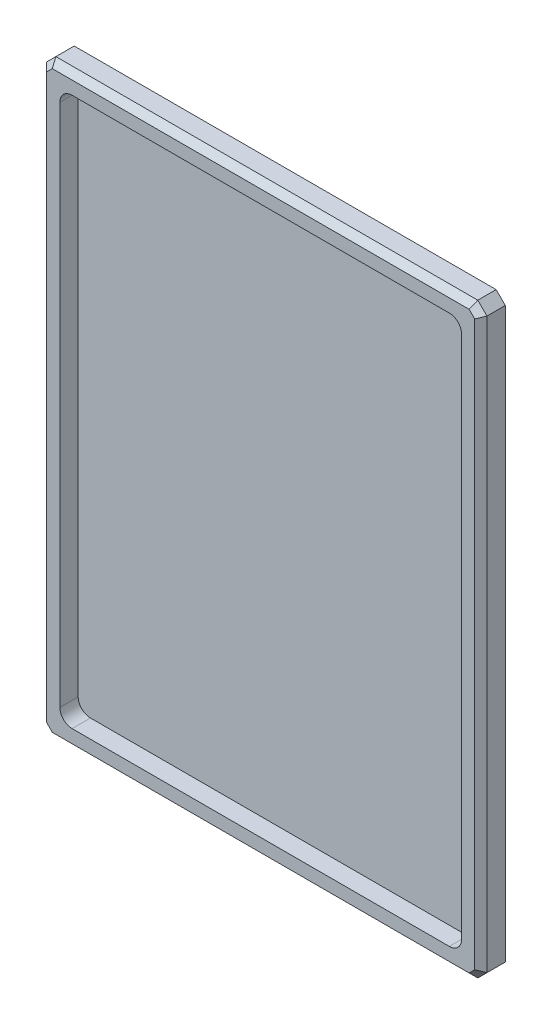
ISO-10303-21;
HEADER;
FILE_DESCRIPTION(('STEP AP214'),'2;1');
FILE_NAME('part.step','',(''),(''),'','','');
FILE_SCHEMA(('AUTOMOTIVE_DESIGN { 1 0 10303 214 1 1 1 1 }'));
ENDSEC;
DATA;
#1=APPLICATION_CONTEXT('core data for automotive mechanical design processes');
#2=APPLICATION_PROTOCOL_DEFINITION('international standard','automotive_design',2000,#1);
#3=PRODUCT_CONTEXT('',#1,'mechanical');
#4=PRODUCT('Part','Part','',(#3));
#5=PRODUCT_RELATED_PRODUCT_CATEGORY('part','',(#4));
#6=PRODUCT_DEFINITION_FORMATION('','',#4);
#7=PRODUCT_DEFINITION_CONTEXT('part definition',#1,'design');
#8=PRODUCT_DEFINITION('design','',#6,#7);
#9=PRODUCT_DEFINITION_SHAPE('','',#8);
#10=(LENGTH_UNIT() NAMED_UNIT(*) SI_UNIT(.MILLI.,.METRE.));
#11=(NAMED_UNIT(*) PLANE_ANGLE_UNIT() SI_UNIT($,.RADIAN.));
#12=(NAMED_UNIT(*) SI_UNIT($,.STERADIAN.) SOLID_ANGLE_UNIT());
#13=UNCERTAINTY_MEASURE_WITH_UNIT(LENGTH_MEASURE(1.E-05),#10,'distance_accuracy_value','');
#14=(GEOMETRIC_REPRESENTATION_CONTEXT(3) GLOBAL_UNCERTAINTY_ASSIGNED_CONTEXT((#13)) GLOBAL_UNIT_ASSIGNED_CONTEXT((#10,
#11,#12)) REPRESENTATION_CONTEXT('',''));
#15=CARTESIAN_POINT('',(0.,0.,0.));
#16=DIRECTION('',(0.,0.,1.));
#17=DIRECTION('',(1.,0.,0.));
#18=AXIS2_PLACEMENT_3D('',#15,#16,#17);
#19=CARTESIAN_POINT('',(-114.3,-152.4,12.7));
#20=DIRECTION('',(1.,0.,0.));
#21=DIRECTION('',(0.,0.,-1.));
#22=AXIS2_PLACEMENT_3D('',#19,#20,#21);
#23=PLANE('',#22);
#24=DIRECTION('',(0.,0.,1.));
#25=VECTOR('',#24,1.);
#26=CARTESIAN_POINT('',(-114.3,-147.6375,12.7));
#27=LINE('',#26,#25);
#28=CARTESIAN_POINT('',(-114.3,-147.6375,0.));
#29=VERTEX_POINT('',#28);
#30=CARTESIAN_POINT('',(-114.3,-147.6375,9.52500000000001));
#31=VERTEX_POINT('',#30);
#32=EDGE_CURVE('E284',#29,#31,#27,.T.);
#33=ORIENTED_EDGE('',*,*,#32,.T.);
#34=DIRECTION('',(0.,1.,0.));
#35=VECTOR('',#34,1.);
#36=CARTESIAN_POINT('',(-114.3,147.6375,9.52500000000002));
#37=LINE('',#36,#35);
#38=CARTESIAN_POINT('',(-114.3,147.6375,9.52500000000002));
#39=VERTEX_POINT('',#38);
#40=EDGE_CURVE('E318',#31,#39,#37,.T.);
#41=ORIENTED_EDGE('',*,*,#40,.T.);
#42=DIRECTION('',(0.,0.,-1.));
#43=VECTOR('',#42,1.);
#44=CARTESIAN_POINT('',(-114.3,147.6375,12.7));
#45=LINE('',#44,#43);
#46=CARTESIAN_POINT('',(-114.3,147.6375,0.));
#47=VERTEX_POINT('',#46);
#48=EDGE_CURVE('E282',#39,#47,#45,.T.);
#49=ORIENTED_EDGE('',*,*,#48,.T.);
#50=DIRECTION('',(0.,-1.,0.));
#51=VECTOR('',#50,1.);
#52=CARTESIAN_POINT('',(-114.3,-152.4,0.));
#53=LINE('',#52,#51);
#54=EDGE_CURVE('E246',#47,#29,#53,.T.);
#55=ORIENTED_EDGE('',*,*,#54,.T.);
#56=EDGE_LOOP('',(#33,#41,#49,#55));
#57=FACE_BOUND('',#56,.T.);
#58=ADVANCED_FACE('F44',(#57),#23,.F.);
#59=CARTESIAN_POINT('',(114.3,-152.4,12.7));
#60=DIRECTION('',(0.,1.,0.));
#61=DIRECTION('',(0.,0.,1.));
#62=AXIS2_PLACEMENT_3D('',#59,#60,#61);
#63=PLANE('',#62);
#64=DIRECTION('',(0.,0.,1.));
#65=VECTOR('',#64,1.);
#66=CARTESIAN_POINT('',(109.5375,-152.4,12.7));
#67=LINE('',#66,#65);
#68=CARTESIAN_POINT('',(109.5375,-152.4,0.));
#69=VERTEX_POINT('',#68);
#70=CARTESIAN_POINT('',(109.5375,-152.4,9.52500000000002));
#71=VERTEX_POINT('',#70);
#72=EDGE_CURVE('E269',#69,#71,#67,.T.);
#73=ORIENTED_EDGE('',*,*,#72,.T.);
#74=DIRECTION('',(-1.,0.,0.));
#75=VECTOR('',#74,1.);
#76=CARTESIAN_POINT('',(-109.5375,-152.4,9.52500000000002));
#77=LINE('',#76,#75);
#78=CARTESIAN_POINT('',(-109.5375,-152.4,9.52500000000002));
#79=VERTEX_POINT('',#78);
#80=EDGE_CURVE('E322',#71,#79,#77,.T.);
#81=ORIENTED_EDGE('',*,*,#80,.T.);
#82=DIRECTION('',(0.,0.,-1.));
#83=VECTOR('',#82,1.);
#84=CARTESIAN_POINT('',(-109.5375,-152.4,12.7));
#85=LINE('',#84,#83);
#86=CARTESIAN_POINT('',(-109.5375,-152.4,0.));
#87=VERTEX_POINT('',#86);
#88=EDGE_CURVE('E272',#79,#87,#85,.T.);
#89=ORIENTED_EDGE('',*,*,#88,.T.);
#90=DIRECTION('',(1.,0.,0.));
#91=VECTOR('',#90,1.);
#92=CARTESIAN_POINT('',(114.3,-152.4,0.));
#93=LINE('',#92,#91);
#94=EDGE_CURVE('E260',#87,#69,#93,.T.);
#95=ORIENTED_EDGE('',*,*,#94,.T.);
#96=EDGE_LOOP('',(#73,#81,#89,#95));
#97=FACE_BOUND('',#96,.T.);
#98=ADVANCED_FACE('F362',(#97),#63,.F.);
#99=CARTESIAN_POINT('',(114.3,-152.4,12.7));
#100=DIRECTION('',(-1.,0.,0.));
#101=DIRECTION('',(0.,0.,1.));
#102=AXIS2_PLACEMENT_3D('',#99,#100,#101);
#103=PLANE('',#102);
#104=DIRECTION('',(0.,0.,1.));
#105=VECTOR('',#104,1.);
#106=CARTESIAN_POINT('',(114.3,147.6375,12.7));
#107=LINE('',#106,#105);
#108=CARTESIAN_POINT('',(114.3,147.6375,0.));
#109=VERTEX_POINT('',#108);
#110=CARTESIAN_POINT('',(114.3,147.6375,9.52500000000002));
#111=VERTEX_POINT('',#110);
#112=EDGE_CURVE('E287',#109,#111,#107,.T.);
#113=ORIENTED_EDGE('',*,*,#112,.T.);
#114=DIRECTION('',(0.,-1.,0.));
#115=VECTOR('',#114,1.);
#116=CARTESIAN_POINT('',(114.3,-147.6375,9.52500000000002));
#117=LINE('',#116,#115);
#118=CARTESIAN_POINT('',(114.3,-147.6375,9.52500000000002));
#119=VERTEX_POINT('',#118);
#120=EDGE_CURVE('E54',#111,#119,#117,.T.);
#121=ORIENTED_EDGE('',*,*,#120,.T.);
#122=DIRECTION('',(0.,0.,-1.));
#123=VECTOR('',#122,1.);
#124=CARTESIAN_POINT('',(114.3,-147.6375,12.7));
#125=LINE('',#124,#123);
#126=CARTESIAN_POINT('',(114.3,-147.6375,0.));
#127=VERTEX_POINT('',#126);
#128=EDGE_CURVE('E289',#119,#127,#125,.T.);
#129=ORIENTED_EDGE('',*,*,#128,.T.);
#130=DIRECTION('',(0.,1.,0.));
#131=VECTOR('',#130,1.);
#132=CARTESIAN_POINT('',(114.3,-152.4,0.));
#133=LINE('',#132,#131);
#134=EDGE_CURVE('E263',#127,#109,#133,.T.);
#135=ORIENTED_EDGE('',*,*,#134,.T.);
#136=EDGE_LOOP('',(#113,#121,#129,#135));
#137=FACE_BOUND('',#136,.T.);
#138=ADVANCED_FACE('F372',(#137),#103,.F.);
#139=CARTESIAN_POINT('',(114.3,152.4,12.7));
#140=DIRECTION('',(0.,-1.,0.));
#141=DIRECTION('',(0.,0.,-1.));
#142=AXIS2_PLACEMENT_3D('',#139,#140,#141);
#143=PLANE('',#142);
#144=DIRECTION('',(0.,0.,1.));
#145=VECTOR('',#144,1.);
#146=CARTESIAN_POINT('',(-109.5375,152.4,12.7));
#147=LINE('',#146,#145);
#148=CARTESIAN_POINT('',(-109.5375,152.4,0.));
#149=VERTEX_POINT('',#148);
#150=CARTESIAN_POINT('',(-109.5375,152.4,9.52500000000002));
#151=VERTEX_POINT('',#150);
#152=EDGE_CURVE('E293',#149,#151,#147,.T.);
#153=ORIENTED_EDGE('',*,*,#152,.T.);
#154=DIRECTION('',(1.,0.,0.));
#155=VECTOR('',#154,1.);
#156=CARTESIAN_POINT('',(109.5375,152.4,9.52500000000002));
#157=LINE('',#156,#155);
#158=CARTESIAN_POINT('',(109.5375,152.4,9.52500000000002));
#159=VERTEX_POINT('',#158);
#160=EDGE_CURVE('E316',#151,#159,#157,.T.);
#161=ORIENTED_EDGE('',*,*,#160,.T.);
#162=DIRECTION('',(0.,0.,-1.));
#163=VECTOR('',#162,1.);
#164=CARTESIAN_POINT('',(109.5375,152.4,12.7));
#165=LINE('',#164,#163);
#166=CARTESIAN_POINT('',(109.5375,152.4,0.));
#167=VERTEX_POINT('',#166);
#168=EDGE_CURVE('E291',#159,#167,#165,.T.);
#169=ORIENTED_EDGE('',*,*,#168,.T.);
#170=DIRECTION('',(-1.,0.,0.));
#171=VECTOR('',#170,1.);
#172=CARTESIAN_POINT('',(114.3,152.4,0.));
#173=LINE('',#172,#171);
#174=EDGE_CURVE('E266',#167,#149,#173,.T.);
#175=ORIENTED_EDGE('',*,*,#174,.T.);
#176=EDGE_LOOP('',(#153,#161,#169,#175));
#177=FACE_BOUND('',#176,.T.);
#178=ADVANCED_FACE('F377',(#177),#143,.F.);
#179=CARTESIAN_POINT('',(0.,0.,12.7));
#180=DIRECTION('',(0.,0.,1.));
#181=DIRECTION('',(1.,0.,0.));
#182=AXIS2_PLACEMENT_3D('',#179,#180,#181);
#183=PLANE('',#182);
#184=DIRECTION('',(-1.,0.,0.));
#185=VECTOR('',#184,1.);
#186=CARTESIAN_POINT('',(-109.5375,149.225,12.7));
#187=LINE('',#186,#185);
#188=CARTESIAN_POINT('',(108.222371939465,149.225,12.7));
#189=VERTEX_POINT('',#188);
#190=CARTESIAN_POINT('',(-108.222371939465,149.225,12.7));
#191=VERTEX_POINT('',#190);
#192=EDGE_CURVE('E308',#189,#191,#187,.T.);
#193=ORIENTED_EDGE('',*,*,#192,.T.);
#194=DIRECTION('',(-0.707106781186548,-0.707106781186548,0.));
#195=VECTOR('',#194,1.);
#196=CARTESIAN_POINT('',(-128.723685969733,128.723685969733,12.7));
#197=LINE('',#196,#195);
#198=CARTESIAN_POINT('',(-111.125,146.322371939465,12.7));
#199=VERTEX_POINT('',#198);
#200=EDGE_CURVE('E310',#191,#199,#197,.T.);
#201=ORIENTED_EDGE('',*,*,#200,.T.);
#202=DIRECTION('',(0.,-1.,0.));
#203=VECTOR('',#202,1.);
#204=CARTESIAN_POINT('',(-111.125,-147.6375,12.7));
#205=LINE('',#204,#203);
#206=CARTESIAN_POINT('',(-111.125,-146.322371939465,12.7));
#207=VERTEX_POINT('',#206);
#208=EDGE_CURVE('E306',#199,#207,#205,.T.);
#209=ORIENTED_EDGE('',*,*,#208,.T.);
#210=DIRECTION('',(0.707106781186548,-0.707106781186548,0.));
#211=VECTOR('',#210,1.);
#212=CARTESIAN_POINT('',(-128.723685969733,-128.723685969733,12.7));
#213=LINE('',#212,#211);
#214=CARTESIAN_POINT('',(-108.222371939465,-149.225,12.7));
#215=VERTEX_POINT('',#214);
#216=EDGE_CURVE('E304',#207,#215,#213,.T.);
#217=ORIENTED_EDGE('',*,*,#216,.T.);
#218=DIRECTION('',(1.,0.,0.));
#219=VECTOR('',#218,1.);
#220=CARTESIAN_POINT('',(109.5375,-149.225,12.7));
#221=LINE('',#220,#219);
#222=CARTESIAN_POINT('',(108.222371939465,-149.225,12.7));
#223=VERTEX_POINT('',#222);
#224=EDGE_CURVE('E302',#215,#223,#221,.T.);
#225=ORIENTED_EDGE('',*,*,#224,.T.);
#226=DIRECTION('',(0.707106781186548,0.707106781186548,0.));
#227=VECTOR('',#226,1.);
#228=CARTESIAN_POINT('',(128.723685969733,-128.723685969733,12.7));
#229=LINE('',#228,#227);
#230=CARTESIAN_POINT('',(111.125,-146.322371939465,12.7));
#231=VERTEX_POINT('',#230);
#232=EDGE_CURVE('E300',#223,#231,#229,.T.);
#233=ORIENTED_EDGE('',*,*,#232,.T.);
#234=DIRECTION('',(0.,1.,0.));
#235=VECTOR('',#234,1.);
#236=CARTESIAN_POINT('',(111.125,147.6375,12.7));
#237=LINE('',#236,#235);
#238=CARTESIAN_POINT('',(111.125,146.322371939465,12.7));
#239=VERTEX_POINT('',#238);
#240=EDGE_CURVE('E298',#231,#239,#237,.T.);
#241=ORIENTED_EDGE('',*,*,#240,.T.);
#242=DIRECTION('',(-0.707106781186548,0.707106781186548,0.));
#243=VECTOR('',#242,1.);
#244=CARTESIAN_POINT('',(128.723685969733,128.723685969733,12.7));
#245=LINE('',#244,#243);
#246=EDGE_CURVE('E296',#239,#189,#245,.T.);
#247=ORIENTED_EDGE('',*,*,#246,.T.);
#248=EDGE_LOOP('',(#193,#201,#209,#217,#225,#233,#241,#247));
#249=FACE_BOUND('',#248,.T.);
#250=CARTESIAN_POINT('',(-97.95,-136.05,12.7));
#251=DIRECTION('',(0.,0.,1.));
#252=DIRECTION('',(-1.,0.,0.));
#253=AXIS2_PLACEMENT_3D('',#250,#251,#252);
#254=CIRCLE('',#253,6.34999999999999);
#255=CARTESIAN_POINT('',(-104.3,-136.05,12.7));
#256=VERTEX_POINT('',#255);
#257=CARTESIAN_POINT('',(-97.95,-142.4,12.7));
#258=VERTEX_POINT('',#257);
#259=EDGE_CURVE('E190',#256,#258,#254,.T.);
#260=ORIENTED_EDGE('',*,*,#259,.F.);
#261=DIRECTION('',(0.,-1.,0.));
#262=VECTOR('',#261,1.);
#263=CARTESIAN_POINT('',(-104.3,-136.05,12.7));
#264=LINE('',#263,#262);
#265=CARTESIAN_POINT('',(-104.3,136.05,12.7));
#266=VERTEX_POINT('',#265);
#267=EDGE_CURVE('E208',#266,#256,#264,.T.);
#268=ORIENTED_EDGE('',*,*,#267,.F.);
#269=CARTESIAN_POINT('',(-97.95,136.05,12.7));
#270=DIRECTION('',(0.,0.,1.));
#271=DIRECTION('',(1.,0.,0.));
#272=AXIS2_PLACEMENT_3D('',#269,#270,#271);
#273=CIRCLE('',#272,6.34999999999999);
#274=CARTESIAN_POINT('',(-97.95,142.4,12.7));
#275=VERTEX_POINT('',#274);
#276=EDGE_CURVE('E211',#275,#266,#273,.T.);
#277=ORIENTED_EDGE('',*,*,#276,.F.);
#278=DIRECTION('',(-1.,0.,0.));
#279=VECTOR('',#278,1.);
#280=CARTESIAN_POINT('',(97.9500000000001,142.4,12.7));
#281=LINE('',#280,#279);
#282=CARTESIAN_POINT('',(97.9500000000001,142.4,12.7));
#283=VERTEX_POINT('',#282);
#284=EDGE_CURVE('E239',#283,#275,#281,.T.);
#285=ORIENTED_EDGE('',*,*,#284,.F.);
#286=CARTESIAN_POINT('',(97.9500000000001,136.05,12.7));
#287=DIRECTION('',(0.,0.,1.));
#288=DIRECTION('',(1.,0.,0.));
#289=AXIS2_PLACEMENT_3D('',#286,#287,#288);
#290=CIRCLE('',#289,6.34999999999999);
#291=CARTESIAN_POINT('',(104.3,136.05,12.7));
#292=VERTEX_POINT('',#291);
#293=EDGE_CURVE('E236',#292,#283,#290,.T.);
#294=ORIENTED_EDGE('',*,*,#293,.F.);
#295=DIRECTION('',(0.,1.,0.));
#296=VECTOR('',#295,1.);
#297=CARTESIAN_POINT('',(104.3,-136.05,12.7));
#298=LINE('',#297,#296);
#299=CARTESIAN_POINT('',(104.3,-136.05,12.7));
#300=VERTEX_POINT('',#299);
#301=EDGE_CURVE('E233',#300,#292,#298,.T.);
#302=ORIENTED_EDGE('',*,*,#301,.F.);
#303=CARTESIAN_POINT('',(97.9500000000001,-136.05,12.7));
#304=DIRECTION('',(0.,0.,1.));
#305=DIRECTION('',(1.,0.,0.));
#306=AXIS2_PLACEMENT_3D('',#303,#304,#305);
#307=CIRCLE('',#306,6.34999999999999);
#308=CARTESIAN_POINT('',(97.9500000000001,-142.4,12.7));
#309=VERTEX_POINT('',#308);
#310=EDGE_CURVE('E230',#309,#300,#307,.T.);
#311=ORIENTED_EDGE('',*,*,#310,.F.);
#312=DIRECTION('',(1.,0.,0.));
#313=VECTOR('',#312,1.);
#314=CARTESIAN_POINT('',(97.9500000000001,-142.4,12.7));
#315=LINE('',#314,#313);
#316=EDGE_CURVE('E228',#258,#309,#315,.T.);
#317=ORIENTED_EDGE('',*,*,#316,.F.);
#318=EDGE_LOOP('',(#260,#268,#277,#285,#294,#302,#311,#317));
#319=FACE_BOUND('',#318,.T.);
#320=ADVANCED_FACE('F395',(#249,#319),#183,.T.);
#321=CARTESIAN_POINT('',(0.,0.,0.));
#322=DIRECTION('',(0.,0.,1.));
#323=DIRECTION('',(1.,0.,0.));
#324=AXIS2_PLACEMENT_3D('',#321,#322,#323);
#325=PLANE('',#324);
#326=ORIENTED_EDGE('',*,*,#94,.F.);
#327=DIRECTION('',(0.707106781186548,-0.707106781186548,0.));
#328=VECTOR('',#327,1.);
#329=CARTESIAN_POINT('',(-109.5375,-152.4,0.));
#330=LINE('',#329,#328);
#331=EDGE_CURVE('E280',#87,#29,#330,.F.);
#332=ORIENTED_EDGE('',*,*,#331,.T.);
#333=ORIENTED_EDGE('',*,*,#54,.F.);
#334=DIRECTION('',(-0.707106781186548,-0.707106781186548,0.));
#335=VECTOR('',#334,1.);
#336=CARTESIAN_POINT('',(-114.3,147.6375,0.));
#337=LINE('',#336,#335);
#338=EDGE_CURVE('E276',#47,#149,#337,.F.);
#339=ORIENTED_EDGE('',*,*,#338,.T.);
#340=ORIENTED_EDGE('',*,*,#174,.F.);
#341=DIRECTION('',(-0.707106781186548,0.707106781186548,0.));
#342=VECTOR('',#341,1.);
#343=CARTESIAN_POINT('',(109.5375,152.4,0.));
#344=LINE('',#343,#342);
#345=EDGE_CURVE('E274',#167,#109,#344,.F.);
#346=ORIENTED_EDGE('',*,*,#345,.T.);
#347=ORIENTED_EDGE('',*,*,#134,.F.);
#348=DIRECTION('',(0.707106781186548,0.707106781186548,0.));
#349=VECTOR('',#348,1.);
#350=CARTESIAN_POINT('',(114.3,-147.6375,0.));
#351=LINE('',#350,#349);
#352=EDGE_CURVE('E278',#127,#69,#351,.F.);
#353=ORIENTED_EDGE('',*,*,#352,.T.);
#354=EDGE_LOOP('',(#326,#332,#333,#339,#340,#346,#347,#353));
#355=FACE_BOUND('',#354,.T.);
#356=ADVANCED_FACE('F367',(#355),#325,.F.);
#357=CARTESIAN_POINT('',(-97.95,-136.05,3.175));
#358=DIRECTION('',(0.,0.,1.));
#359=DIRECTION('',(1.,0.,0.));
#360=AXIS2_PLACEMENT_3D('',#357,#358,#359);
#361=CYLINDRICAL_SURFACE('',#360,6.34999999999999);
#362=ORIENTED_EDGE('',*,*,#259,.T.);
#363=DIRECTION('',(0.,0.,1.));
#364=VECTOR('',#363,1.);
#365=CARTESIAN_POINT('',(-97.95,-142.4,3.175));
#366=LINE('',#365,#364);
#367=CARTESIAN_POINT('',(-97.95,-142.4,3.175));
#368=VERTEX_POINT('',#367);
#369=EDGE_CURVE('E183',#368,#258,#366,.T.);
#370=ORIENTED_EDGE('',*,*,#369,.F.);
#371=CARTESIAN_POINT('',(-97.95,-136.05,3.175));
#372=DIRECTION('',(0.,0.,1.));
#373=DIRECTION('',(-1.,0.,0.));
#374=AXIS2_PLACEMENT_3D('',#371,#372,#373);
#375=CIRCLE('',#374,6.34999999999999);
#376=CARTESIAN_POINT('',(-104.3,-136.05,3.175));
#377=VERTEX_POINT('',#376);
#378=EDGE_CURVE('E187',#377,#368,#375,.T.);
#379=ORIENTED_EDGE('',*,*,#378,.F.);
#380=DIRECTION('',(0.,0.,1.));
#381=VECTOR('',#380,1.);
#382=CARTESIAN_POINT('',(-104.3,-136.05,3.175));
#383=LINE('',#382,#381);
#384=EDGE_CURVE('E244',#377,#256,#383,.T.);
#385=ORIENTED_EDGE('',*,*,#384,.T.);
#386=EDGE_LOOP('',(#362,#370,#379,#385));
#387=FACE_BOUND('',#386,.T.);
#388=ADVANCED_FACE('F185',(#387),#361,.F.);
#389=CARTESIAN_POINT('',(-104.3,-136.05,3.175));
#390=DIRECTION('',(-1.,0.,0.));
#391=DIRECTION('',(0.,0.,1.));
#392=AXIS2_PLACEMENT_3D('',#389,#390,#391);
#393=PLANE('',#392);
#394=ORIENTED_EDGE('',*,*,#267,.T.);
#395=ORIENTED_EDGE('',*,*,#384,.F.);
#396=DIRECTION('',(0.,-1.,0.));
#397=VECTOR('',#396,1.);
#398=CARTESIAN_POINT('',(-104.3,-136.05,3.175));
#399=LINE('',#398,#397);
#400=CARTESIAN_POINT('',(-104.3,136.05,3.175));
#401=VERTEX_POINT('',#400);
#402=EDGE_CURVE('E195',#401,#377,#399,.T.);
#403=ORIENTED_EDGE('',*,*,#402,.F.);
#404=DIRECTION('',(0.,0.,1.));
#405=VECTOR('',#404,1.);
#406=CARTESIAN_POINT('',(-104.3,136.05,3.175));
#407=LINE('',#406,#405);
#408=EDGE_CURVE('E247',#401,#266,#407,.T.);
#409=ORIENTED_EDGE('',*,*,#408,.T.);
#410=EDGE_LOOP('',(#394,#395,#403,#409));
#411=FACE_BOUND('',#410,.T.);
#412=ADVANCED_FACE('F549',(#411),#393,.F.);
#413=CARTESIAN_POINT('',(-97.95,136.05,3.175));
#414=DIRECTION('',(0.,0.,1.));
#415=DIRECTION('',(1.,0.,0.));
#416=AXIS2_PLACEMENT_3D('',#413,#414,#415);
#417=CYLINDRICAL_SURFACE('',#416,6.34999999999999);
#418=ORIENTED_EDGE('',*,*,#276,.T.);
#419=ORIENTED_EDGE('',*,*,#408,.F.);
#420=CARTESIAN_POINT('',(-97.95,136.05,3.175));
#421=DIRECTION('',(0.,0.,1.));
#422=DIRECTION('',(1.,0.,0.));
#423=AXIS2_PLACEMENT_3D('',#420,#421,#422);
#424=CIRCLE('',#423,6.34999999999999);
#425=CARTESIAN_POINT('',(-97.95,142.4,3.175));
#426=VERTEX_POINT('',#425);
#427=EDGE_CURVE('E224',#426,#401,#424,.T.);
#428=ORIENTED_EDGE('',*,*,#427,.F.);
#429=DIRECTION('',(0.,0.,1.));
#430=VECTOR('',#429,1.);
#431=CARTESIAN_POINT('',(-97.95,142.4,3.175));
#432=LINE('',#431,#430);
#433=EDGE_CURVE('E249',#426,#275,#432,.T.);
#434=ORIENTED_EDGE('',*,*,#433,.T.);
#435=EDGE_LOOP('',(#418,#419,#428,#434));
#436=FACE_BOUND('',#435,.T.);
#437=ADVANCED_FACE('F541',(#436),#417,.F.);
#438=CARTESIAN_POINT('',(97.9500000000001,142.4,3.175));
#439=DIRECTION('',(0.,1.,0.));
#440=DIRECTION('',(0.,0.,1.));
#441=AXIS2_PLACEMENT_3D('',#438,#439,#440);
#442=PLANE('',#441);
#443=ORIENTED_EDGE('',*,*,#284,.T.);
#444=ORIENTED_EDGE('',*,*,#433,.F.);
#445=DIRECTION('',(-1.,0.,0.));
#446=VECTOR('',#445,1.);
#447=CARTESIAN_POINT('',(97.9500000000001,142.4,3.175));
#448=LINE('',#447,#446);
#449=CARTESIAN_POINT('',(97.9500000000001,142.4,3.175));
#450=VERTEX_POINT('',#449);
#451=EDGE_CURVE('E221',#450,#426,#448,.T.);
#452=ORIENTED_EDGE('',*,*,#451,.F.);
#453=DIRECTION('',(0.,0.,1.));
#454=VECTOR('',#453,1.);
#455=CARTESIAN_POINT('',(97.9500000000001,142.4,3.175));
#456=LINE('',#455,#454);
#457=EDGE_CURVE('E251',#450,#283,#456,.T.);
#458=ORIENTED_EDGE('',*,*,#457,.T.);
#459=EDGE_LOOP('',(#443,#444,#452,#458));
#460=FACE_BOUND('',#459,.T.);
#461=ADVANCED_FACE('F533',(#460),#442,.F.);
#462=CARTESIAN_POINT('',(97.9500000000001,136.05,3.175));
#463=DIRECTION('',(0.,0.,1.));
#464=DIRECTION('',(1.,0.,0.));
#465=AXIS2_PLACEMENT_3D('',#462,#463,#464);
#466=CYLINDRICAL_SURFACE('',#465,6.34999999999999);
#467=ORIENTED_EDGE('',*,*,#293,.T.);
#468=ORIENTED_EDGE('',*,*,#457,.F.);
#469=CARTESIAN_POINT('',(97.9500000000001,136.05,3.175));
#470=DIRECTION('',(0.,0.,1.));
#471=DIRECTION('',(1.,0.,0.));
#472=AXIS2_PLACEMENT_3D('',#469,#470,#471);
#473=CIRCLE('',#472,6.34999999999999);
#474=CARTESIAN_POINT('',(104.3,136.05,3.175));
#475=VERTEX_POINT('',#474);
#476=EDGE_CURVE('E218',#475,#450,#473,.T.);
#477=ORIENTED_EDGE('',*,*,#476,.F.);
#478=DIRECTION('',(0.,0.,1.));
#479=VECTOR('',#478,1.);
#480=CARTESIAN_POINT('',(104.3,136.05,3.175));
#481=LINE('',#480,#479);
#482=EDGE_CURVE('E253',#475,#292,#481,.T.);
#483=ORIENTED_EDGE('',*,*,#482,.T.);
#484=EDGE_LOOP('',(#467,#468,#477,#483));
#485=FACE_BOUND('',#484,.T.);
#486=ADVANCED_FACE('F525',(#485),#466,.F.);
#487=CARTESIAN_POINT('',(104.3,-136.05,3.175));
#488=DIRECTION('',(1.,0.,0.));
#489=DIRECTION('',(0.,0.,-1.));
#490=AXIS2_PLACEMENT_3D('',#487,#488,#489);
#491=PLANE('',#490);
#492=ORIENTED_EDGE('',*,*,#301,.T.);
#493=ORIENTED_EDGE('',*,*,#482,.F.);
#494=DIRECTION('',(0.,1.,0.));
#495=VECTOR('',#494,1.);
#496=CARTESIAN_POINT('',(104.3,-136.05,3.175));
#497=LINE('',#496,#495);
#498=CARTESIAN_POINT('',(104.3,-136.05,3.175));
#499=VERTEX_POINT('',#498);
#500=EDGE_CURVE('E215',#499,#475,#497,.T.);
#501=ORIENTED_EDGE('',*,*,#500,.F.);
#502=DIRECTION('',(0.,0.,1.));
#503=VECTOR('',#502,1.);
#504=CARTESIAN_POINT('',(104.3,-136.05,3.175));
#505=LINE('',#504,#503);
#506=EDGE_CURVE('E255',#499,#300,#505,.T.);
#507=ORIENTED_EDGE('',*,*,#506,.T.);
#508=EDGE_LOOP('',(#492,#493,#501,#507));
#509=FACE_BOUND('',#508,.T.);
#510=ADVANCED_FACE('F517',(#509),#491,.F.);
#511=CARTESIAN_POINT('',(97.9500000000001,-136.05,3.175));
#512=DIRECTION('',(0.,0.,1.));
#513=DIRECTION('',(1.,0.,0.));
#514=AXIS2_PLACEMENT_3D('',#511,#512,#513);
#515=CYLINDRICAL_SURFACE('',#514,6.34999999999999);
#516=ORIENTED_EDGE('',*,*,#310,.T.);
#517=ORIENTED_EDGE('',*,*,#506,.F.);
#518=CARTESIAN_POINT('',(97.9500000000001,-136.05,3.175));
#519=DIRECTION('',(0.,0.,1.));
#520=DIRECTION('',(1.,0.,0.));
#521=AXIS2_PLACEMENT_3D('',#518,#519,#520);
#522=CIRCLE('',#521,6.34999999999999);
#523=CARTESIAN_POINT('',(97.9500000000001,-142.4,3.175));
#524=VERTEX_POINT('',#523);
#525=EDGE_CURVE('E203',#524,#499,#522,.T.);
#526=ORIENTED_EDGE('',*,*,#525,.F.);
#527=DIRECTION('',(0.,0.,1.));
#528=VECTOR('',#527,1.);
#529=CARTESIAN_POINT('',(97.9500000000001,-142.4,3.175));
#530=LINE('',#529,#528);
#531=EDGE_CURVE('E194',#524,#309,#530,.T.);
#532=ORIENTED_EDGE('',*,*,#531,.T.);
#533=EDGE_LOOP('',(#516,#517,#526,#532));
#534=FACE_BOUND('',#533,.T.);
#535=ADVANCED_FACE('F510',(#534),#515,.F.);
#536=CARTESIAN_POINT('',(97.9500000000001,-142.4,3.175));
#537=DIRECTION('',(0.,-1.,0.));
#538=DIRECTION('',(0.,0.,-1.));
#539=AXIS2_PLACEMENT_3D('',#536,#537,#538);
#540=PLANE('',#539);
#541=ORIENTED_EDGE('',*,*,#316,.T.);
#542=ORIENTED_EDGE('',*,*,#531,.F.);
#543=DIRECTION('',(1.,0.,0.));
#544=VECTOR('',#543,1.);
#545=CARTESIAN_POINT('',(97.9500000000001,-142.4,3.175));
#546=LINE('',#545,#544);
#547=EDGE_CURVE('E198',#368,#524,#546,.T.);
#548=ORIENTED_EDGE('',*,*,#547,.F.);
#549=ORIENTED_EDGE('',*,*,#369,.T.);
#550=EDGE_LOOP('',(#541,#542,#548,#549));
#551=FACE_BOUND('',#550,.T.);
#552=ADVANCED_FACE('F199',(#551),#540,.F.);
#553=CARTESIAN_POINT('',(-97.95,-136.05,3.175));
#554=DIRECTION('',(0.,0.,-1.));
#555=DIRECTION('',(-1.,0.,0.));
#556=AXIS2_PLACEMENT_3D('',#553,#554,#555);
#557=PLANE('',#556);
#558=ORIENTED_EDGE('',*,*,#378,.T.);
#559=ORIENTED_EDGE('',*,*,#547,.T.);
#560=ORIENTED_EDGE('',*,*,#525,.T.);
#561=ORIENTED_EDGE('',*,*,#500,.T.);
#562=ORIENTED_EDGE('',*,*,#476,.T.);
#563=ORIENTED_EDGE('',*,*,#451,.T.);
#564=ORIENTED_EDGE('',*,*,#427,.T.);
#565=ORIENTED_EDGE('',*,*,#402,.T.);
#566=EDGE_LOOP('',(#558,#559,#560,#561,#562,#563,#564,#565));
#567=FACE_BOUND('',#566,.T.);
#568=ADVANCED_FACE('F205',(#567),#557,.F.);
#569=CARTESIAN_POINT('',(-109.5375,-152.4,12.7));
#570=DIRECTION('',(0.707106781186547,0.707106781186547,0.));
#571=DIRECTION('',(0.,0.,-1.));
#572=AXIS2_PLACEMENT_3D('',#569,#570,#571);
#573=PLANE('',#572);
#574=ORIENTED_EDGE('',*,*,#88,.F.);
#575=DIRECTION('',(0.707106781186548,-0.707106781186548,0.));
#576=VECTOR('',#575,1.);
#577=CARTESIAN_POINT('',(-109.5375,-152.4,9.52500000000001));
#578=LINE('',#577,#576);
#579=EDGE_CURVE('E320',#79,#31,#578,.F.);
#580=ORIENTED_EDGE('',*,*,#579,.T.);
#581=ORIENTED_EDGE('',*,*,#32,.F.);
#582=ORIENTED_EDGE('',*,*,#331,.F.);
#583=EDGE_LOOP('',(#574,#580,#581,#582));
#584=FACE_BOUND('',#583,.T.);
#585=ADVANCED_FACE('F426',(#584),#573,.F.);
#586=CARTESIAN_POINT('',(114.3,-147.6375,12.7));
#587=DIRECTION('',(-0.707106781186547,0.707106781186547,0.));
#588=DIRECTION('',(0.,0.,-1.));
#589=AXIS2_PLACEMENT_3D('',#586,#587,#588);
#590=PLANE('',#589);
#591=ORIENTED_EDGE('',*,*,#128,.F.);
#592=DIRECTION('',(0.707106781186548,0.707106781186548,0.));
#593=VECTOR('',#592,1.);
#594=CARTESIAN_POINT('',(114.3,-147.6375,9.52500000000002));
#595=LINE('',#594,#593);
#596=EDGE_CURVE('E324',#119,#71,#595,.F.);
#597=ORIENTED_EDGE('',*,*,#596,.T.);
#598=ORIENTED_EDGE('',*,*,#72,.F.);
#599=ORIENTED_EDGE('',*,*,#352,.F.);
#600=EDGE_LOOP('',(#591,#597,#598,#599));
#601=FACE_BOUND('',#600,.T.);
#602=ADVANCED_FACE('F359',(#601),#590,.F.);
#603=CARTESIAN_POINT('',(-114.3,147.6375,12.7));
#604=DIRECTION('',(0.707106781186547,-0.707106781186547,0.));
#605=DIRECTION('',(0.,0.,-1.));
#606=AXIS2_PLACEMENT_3D('',#603,#604,#605);
#607=PLANE('',#606);
#608=ORIENTED_EDGE('',*,*,#48,.F.);
#609=DIRECTION('',(-0.707106781186548,-0.707106781186548,0.));
#610=VECTOR('',#609,1.);
#611=CARTESIAN_POINT('',(-114.3,147.6375,9.52500000000002));
#612=LINE('',#611,#610);
#613=EDGE_CURVE('E313',#39,#151,#612,.F.);
#614=ORIENTED_EDGE('',*,*,#613,.T.);
#615=ORIENTED_EDGE('',*,*,#152,.F.);
#616=ORIENTED_EDGE('',*,*,#338,.F.);
#617=EDGE_LOOP('',(#608,#614,#615,#616));
#618=FACE_BOUND('',#617,.T.);
#619=ADVANCED_FACE('F380',(#618),#607,.F.);
#620=CARTESIAN_POINT('',(109.5375,152.4,12.7));
#621=DIRECTION('',(-0.707106781186547,-0.707106781186547,0.));
#622=DIRECTION('',(0.,0.,-1.));
#623=AXIS2_PLACEMENT_3D('',#620,#621,#622);
#624=PLANE('',#623);
#625=ORIENTED_EDGE('',*,*,#168,.F.);
#626=DIRECTION('',(-0.707106781186548,0.707106781186548,0.));
#627=VECTOR('',#626,1.);
#628=CARTESIAN_POINT('',(109.5375,152.4,9.52500000000002));
#629=LINE('',#628,#627);
#630=EDGE_CURVE('E11',#159,#111,#629,.F.);
#631=ORIENTED_EDGE('',*,*,#630,.T.);
#632=ORIENTED_EDGE('',*,*,#112,.F.);
#633=ORIENTED_EDGE('',*,*,#345,.F.);
#634=EDGE_LOOP('',(#625,#631,#632,#633));
#635=FACE_BOUND('',#634,.T.);
#636=ADVANCED_FACE('F373',(#635),#624,.F.);
#637=CARTESIAN_POINT('',(128.723685969733,-128.723685969733,12.7));
#638=DIRECTION('',(0.499999999999998,-0.499999999999998,0.70710678118655));
#639=DIRECTION('',(-0.707106781186548,-0.707106781186548,0.));
#640=AXIS2_PLACEMENT_3D('',#637,#638,#639);
#641=PLANE('',#640);
#642=DIRECTION('',(0.281084637714827,-0.678598344545846,-0.678598344545846));
#643=VECTOR('',#642,1.);
#644=CARTESIAN_POINT('',(105.931657692737,-143.694726598028,18.2302734019722));
#645=LINE('',#644,#643);
#646=EDGE_CURVE('E342',#71,#223,#645,.F.);
#647=ORIENTED_EDGE('',*,*,#646,.F.);
#648=ORIENTED_EDGE('',*,*,#596,.F.);
#649=DIRECTION('',(0.678598344545846,-0.281084637714827,-0.678598344545846));
#650=VECTOR('',#649,1.);
#651=CARTESIAN_POINT('',(83.2149484301928,-134.761650052718,40.6100515698072));
#652=LINE('',#651,#650);
#653=EDGE_CURVE('E49',#231,#119,#652,.T.);
#654=ORIENTED_EDGE('',*,*,#653,.F.);
#655=ORIENTED_EDGE('',*,*,#232,.F.);
#656=EDGE_LOOP('',(#647,#648,#654,#655));
#657=FACE_BOUND('',#656,.T.);
#658=ADVANCED_FACE('F47',(#657),#641,.T.);
#659=CARTESIAN_POINT('',(111.125,0.,12.7));
#660=DIRECTION('',(0.707106781186548,0.,0.707106781186548));
#661=DIRECTION('',(0.,-1.,0.));
#662=AXIS2_PLACEMENT_3D('',#659,#660,#661);
#663=PLANE('',#662);
#664=ORIENTED_EDGE('',*,*,#653,.T.);
#665=ORIENTED_EDGE('',*,*,#120,.F.);
#666=DIRECTION('',(0.678598344545846,0.281084637714827,-0.678598344545846));
#667=VECTOR('',#666,1.);
#668=CARTESIAN_POINT('',(115.87228326118,148.288761050673,7.95271673882039));
#669=LINE('',#668,#667);
#670=EDGE_CURVE('E340',#239,#111,#669,.T.);
#671=ORIENTED_EDGE('',*,*,#670,.F.);
#672=ORIENTED_EDGE('',*,*,#240,.F.);
#673=EDGE_LOOP('',(#664,#665,#671,#672));
#674=FACE_BOUND('',#673,.T.);
#675=ADVANCED_FACE('F352',(#674),#663,.T.);
#676=CARTESIAN_POINT('',(0.,-149.225,12.7));
#677=DIRECTION('',(0.,-0.707106781186548,0.707106781186548));
#678=DIRECTION('',(-1.,0.,0.));
#679=AXIS2_PLACEMENT_3D('',#676,#677,#678);
#680=PLANE('',#679);
#681=ORIENTED_EDGE('',*,*,#646,.T.);
#682=ORIENTED_EDGE('',*,*,#224,.F.);
#683=DIRECTION('',(-0.281084637714832,-0.678598344545845,-0.678598344545845));
#684=VECTOR('',#683,1.);
#685=CARTESIAN_POINT('',(-99.6718767053266,-128.582278440736,33.3427215592635));
#686=LINE('',#685,#684);
#687=EDGE_CURVE('E337',#79,#215,#686,.F.);
#688=ORIENTED_EDGE('',*,*,#687,.F.);
#689=ORIENTED_EDGE('',*,*,#80,.F.);
#690=EDGE_LOOP('',(#681,#682,#688,#689));
#691=FACE_BOUND('',#690,.T.);
#692=ADVANCED_FACE('F406',(#691),#680,.T.);
#693=CARTESIAN_POINT('',(128.723685969733,128.723685969733,12.7));
#694=DIRECTION('',(0.499999999999998,0.499999999999998,0.70710678118655));
#695=DIRECTION('',(0.707106781186548,-0.707106781186548,0.));
#696=AXIS2_PLACEMENT_3D('',#693,#694,#695);
#697=PLANE('',#696);
#698=ORIENTED_EDGE('',*,*,#670,.T.);
#699=ORIENTED_EDGE('',*,*,#630,.F.);
#700=DIRECTION('',(-0.281084637714827,-0.678598344545846,0.678598344545846));
#701=VECTOR('',#700,1.);
#702=CARTESIAN_POINT('',(105.931657692737,143.694726598028,18.2302734019722));
#703=LINE('',#702,#701);
#704=EDGE_CURVE('E334',#189,#159,#703,.F.);
#705=ORIENTED_EDGE('',*,*,#704,.F.);
#706=ORIENTED_EDGE('',*,*,#246,.F.);
#707=EDGE_LOOP('',(#698,#699,#705,#706));
#708=FACE_BOUND('',#707,.T.);
#709=ADVANCED_FACE('F403',(#708),#697,.T.);
#710=CARTESIAN_POINT('',(-128.723685969733,-128.723685969733,12.7));
#711=DIRECTION('',(-0.499999999999997,-0.499999999999997,0.707106781186552));
#712=DIRECTION('',(-0.707106781186548,0.707106781186548,0.));
#713=AXIS2_PLACEMENT_3D('',#710,#711,#712);
#714=PLANE('',#713);
#715=ORIENTED_EDGE('',*,*,#687,.T.);
#716=ORIENTED_EDGE('',*,*,#216,.F.);
#717=DIRECTION('',(-0.678598344545845,-0.281084637714832,-0.678598344545845));
#718=VECTOR('',#717,1.);
#719=CARTESIAN_POINT('',(-115.87228326118,-148.288761050673,7.95271673882048));
#720=LINE('',#719,#718);
#721=EDGE_CURVE('E331',#31,#207,#720,.F.);
#722=ORIENTED_EDGE('',*,*,#721,.F.);
#723=ORIENTED_EDGE('',*,*,#579,.F.);
#724=EDGE_LOOP('',(#715,#716,#722,#723));
#725=FACE_BOUND('',#724,.T.);
#726=ADVANCED_FACE('F405',(#725),#714,.T.);
#727=CARTESIAN_POINT('',(0.,149.225,12.7));
#728=DIRECTION('',(0.,0.707106781186548,0.707106781186548));
#729=DIRECTION('',(1.,0.,0.));
#730=AXIS2_PLACEMENT_3D('',#727,#728,#729);
#731=PLANE('',#730);
#732=ORIENTED_EDGE('',*,*,#704,.T.);
#733=ORIENTED_EDGE('',*,*,#160,.F.);
#734=DIRECTION('',(0.281084637714832,-0.678598344545845,0.678598344545845));
#735=VECTOR('',#734,1.);
#736=CARTESIAN_POINT('',(-99.6718767053266,128.582278440736,33.3427215592636));
#737=LINE('',#736,#735);
#738=EDGE_CURVE('E329',#191,#151,#737,.F.);
#739=ORIENTED_EDGE('',*,*,#738,.F.);
#740=ORIENTED_EDGE('',*,*,#192,.F.);
#741=EDGE_LOOP('',(#732,#733,#739,#740));
#742=FACE_BOUND('',#741,.T.);
#743=ADVANCED_FACE('F401',(#742),#731,.T.);
#744=CARTESIAN_POINT('',(-111.125,0.,12.7));
#745=DIRECTION('',(-0.707106781186548,0.,0.707106781186548));
#746=DIRECTION('',(0.,1.,0.));
#747=AXIS2_PLACEMENT_3D('',#744,#745,#746);
#748=PLANE('',#747);
#749=ORIENTED_EDGE('',*,*,#721,.T.);
#750=ORIENTED_EDGE('',*,*,#208,.F.);
#751=DIRECTION('',(-0.678598344545845,0.281084637714832,-0.678598344545845));
#752=VECTOR('',#751,1.);
#753=CARTESIAN_POINT('',(-83.2149484301924,134.761650052718,40.6100515698077));
#754=LINE('',#753,#752);
#755=EDGE_CURVE('E327',#39,#199,#754,.F.);
#756=ORIENTED_EDGE('',*,*,#755,.F.);
#757=ORIENTED_EDGE('',*,*,#40,.F.);
#758=EDGE_LOOP('',(#749,#750,#756,#757));
#759=FACE_BOUND('',#758,.T.);
#760=ADVANCED_FACE('F391',(#759),#748,.T.);
#761=CARTESIAN_POINT('',(-128.723685969733,128.723685969733,12.7));
#762=DIRECTION('',(-0.499999999999997,0.499999999999997,0.707106781186552));
#763=DIRECTION('',(0.707106781186548,0.707106781186548,0.));
#764=AXIS2_PLACEMENT_3D('',#761,#762,#763);
#765=PLANE('',#764);
#766=ORIENTED_EDGE('',*,*,#738,.T.);
#767=ORIENTED_EDGE('',*,*,#613,.F.);
#768=ORIENTED_EDGE('',*,*,#755,.T.);
#769=ORIENTED_EDGE('',*,*,#200,.F.);
#770=EDGE_LOOP('',(#766,#767,#768,#769));
#771=FACE_BOUND('',#770,.T.);
#772=ADVANCED_FACE('F384',(#771),#765,.T.);
#773=CLOSED_SHELL('',(#58,#98,#138,#178,#320,#356,#388,#412,#437,#461,#486,#510,#535,#552,#568,
#585,#602,#619,#636,#658,#675,#692,#709,#726,#743,#760,#772));
#774=MANIFOLD_SOLID_BREP('B2',#773);
#775=ADVANCED_BREP_SHAPE_REPRESENTATION('',(#18,#774),#14);
#776=SHAPE_DEFINITION_REPRESENTATION(#9,#775);
ENDSEC;
END-ISO-10303-21;
